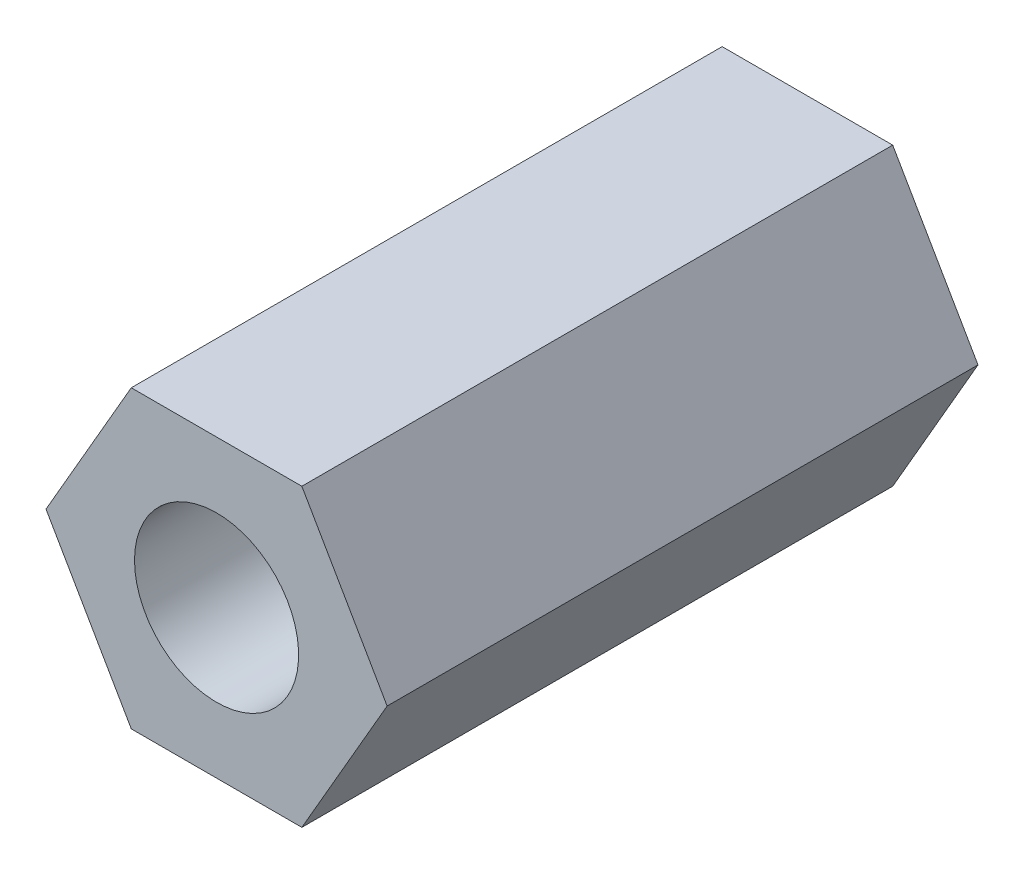
ISO-10303-21;
HEADER;
FILE_DESCRIPTION(('STEP AP214'),'2;1');
FILE_NAME('part.step','',(''),(''),'','','');
FILE_SCHEMA(('AUTOMOTIVE_DESIGN { 1 0 10303 214 1 1 1 1 }'));
ENDSEC;
DATA;
#1=APPLICATION_CONTEXT('core data for automotive mechanical design processes');
#2=APPLICATION_PROTOCOL_DEFINITION('international standard','automotive_design',2000,#1);
#3=PRODUCT_CONTEXT('',#1,'mechanical');
#4=PRODUCT('Part','Part','',(#3));
#5=PRODUCT_RELATED_PRODUCT_CATEGORY('part','',(#4));
#6=PRODUCT_DEFINITION_FORMATION('','',#4);
#7=PRODUCT_DEFINITION_CONTEXT('part definition',#1,'design');
#8=PRODUCT_DEFINITION('design','',#6,#7);
#9=PRODUCT_DEFINITION_SHAPE('','',#8);
#10=(LENGTH_UNIT() NAMED_UNIT(*) SI_UNIT(.MILLI.,.METRE.));
#11=(NAMED_UNIT(*) PLANE_ANGLE_UNIT() SI_UNIT($,.RADIAN.));
#12=(NAMED_UNIT(*) SI_UNIT($,.STERADIAN.) SOLID_ANGLE_UNIT());
#13=UNCERTAINTY_MEASURE_WITH_UNIT(LENGTH_MEASURE(1.E-05),#10,'distance_accuracy_value','');
#14=(GEOMETRIC_REPRESENTATION_CONTEXT(3) GLOBAL_UNCERTAINTY_ASSIGNED_CONTEXT((#13)) GLOBAL_UNIT_ASSIGNED_CONTEXT((#10,
#11,#12)) REPRESENTATION_CONTEXT('',''));
#15=CARTESIAN_POINT('',(0.,0.,0.));
#16=DIRECTION('',(0.,0.,1.));
#17=DIRECTION('',(1.,0.,0.));
#18=AXIS2_PLACEMENT_3D('',#15,#16,#17);
#19=CARTESIAN_POINT('',(1.29903810567668,-2.24999999999998,9.));
#20=DIRECTION('',(-0.866025403784441,0.499999999999995,0.));
#21=DIRECTION('',(-0.499999999999995,-0.866025403784441,0.));
#22=AXIS2_PLACEMENT_3D('',#19,#20,#21);
#23=PLANE('',#22);
#24=DIRECTION('',(0.499999999999995,0.866025403784441,0.));
#25=VECTOR('',#24,1.);
#26=CARTESIAN_POINT('',(1.29903810567668,-2.24999999999998,0.));
#27=LINE('',#26,#25);
#28=CARTESIAN_POINT('',(1.29903810567668,-2.24999999999998,0.));
#29=VERTEX_POINT('',#28);
#30=CARTESIAN_POINT('',(2.59807621135331,0.,0.));
#31=VERTEX_POINT('',#30);
#32=EDGE_CURVE('E127',#29,#31,#27,.T.);
#33=ORIENTED_EDGE('',*,*,#32,.T.);
#34=DIRECTION('',(0.,0.,-1.));
#35=VECTOR('',#34,1.);
#36=CARTESIAN_POINT('',(2.59807621135331,0.,9.));
#37=LINE('',#36,#35);
#38=CARTESIAN_POINT('',(2.59807621135331,0.,9.));
#39=VERTEX_POINT('',#38);
#40=EDGE_CURVE('E11',#39,#31,#37,.T.);
#41=ORIENTED_EDGE('',*,*,#40,.F.);
#42=DIRECTION('',(0.499999999999995,0.866025403784441,0.));
#43=VECTOR('',#42,1.);
#44=CARTESIAN_POINT('',(1.29903810567668,-2.24999999999998,9.));
#45=LINE('',#44,#43);
#46=CARTESIAN_POINT('',(1.29903810567668,-2.24999999999998,9.));
#47=VERTEX_POINT('',#46);
#48=EDGE_CURVE('E138',#47,#39,#45,.T.);
#49=ORIENTED_EDGE('',*,*,#48,.F.);
#50=DIRECTION('',(0.,0.,-1.));
#51=VECTOR('',#50,1.);
#52=CARTESIAN_POINT('',(1.29903810567668,-2.24999999999998,9.));
#53=LINE('',#52,#51);
#54=EDGE_CURVE('E123',#47,#29,#53,.T.);
#55=ORIENTED_EDGE('',*,*,#54,.T.);
#56=EDGE_LOOP('',(#33,#41,#49,#55));
#57=FACE_BOUND('',#56,.T.);
#58=ADVANCED_FACE('F43',(#57),#23,.F.);
#59=CARTESIAN_POINT('',(2.59807621135331,0.,9.));
#60=DIRECTION('',(-0.866025403784438,-0.500000000000001,0.));
#61=DIRECTION('',(0.500000000000001,-0.866025403784438,0.));
#62=AXIS2_PLACEMENT_3D('',#59,#60,#61);
#63=PLANE('',#62);
#64=DIRECTION('',(-0.500000000000001,0.866025403784438,0.));
#65=VECTOR('',#64,1.);
#66=CARTESIAN_POINT('',(2.59807621135331,0.,0.));
#67=LINE('',#66,#65);
#68=CARTESIAN_POINT('',(1.29903810567665,2.25,0.));
#69=VERTEX_POINT('',#68);
#70=EDGE_CURVE('E130',#31,#69,#67,.T.);
#71=ORIENTED_EDGE('',*,*,#70,.T.);
#72=DIRECTION('',(0.,0.,-1.));
#73=VECTOR('',#72,1.);
#74=CARTESIAN_POINT('',(1.29903810567665,2.25,9.));
#75=LINE('',#74,#73);
#76=CARTESIAN_POINT('',(1.29903810567665,2.25,9.));
#77=VERTEX_POINT('',#76);
#78=EDGE_CURVE('E51',#77,#69,#75,.T.);
#79=ORIENTED_EDGE('',*,*,#78,.F.);
#80=DIRECTION('',(-0.500000000000001,0.866025403784438,0.));
#81=VECTOR('',#80,1.);
#82=CARTESIAN_POINT('',(2.59807621135331,0.,9.));
#83=LINE('',#82,#81);
#84=EDGE_CURVE('E96',#39,#77,#83,.T.);
#85=ORIENTED_EDGE('',*,*,#84,.F.);
#86=ORIENTED_EDGE('',*,*,#40,.T.);
#87=EDGE_LOOP('',(#71,#79,#85,#86));
#88=FACE_BOUND('',#87,.T.);
#89=ADVANCED_FACE('F163',(#88),#63,.F.);
#90=CARTESIAN_POINT('',(1.29903810567665,2.25,9.));
#91=DIRECTION('',(0.,-1.,0.));
#92=DIRECTION('',(1.,0.,0.));
#93=AXIS2_PLACEMENT_3D('',#90,#91,#92);
#94=PLANE('',#93);
#95=DIRECTION('',(-1.,0.,0.));
#96=VECTOR('',#95,1.);
#97=CARTESIAN_POINT('',(1.29903810567665,2.25,0.));
#98=LINE('',#97,#96);
#99=CARTESIAN_POINT('',(-1.29903810567667,2.24999999999999,0.));
#100=VERTEX_POINT('',#99);
#101=EDGE_CURVE('E133',#69,#100,#98,.T.);
#102=ORIENTED_EDGE('',*,*,#101,.T.);
#103=DIRECTION('',(0.,0.,-1.));
#104=VECTOR('',#103,1.);
#105=CARTESIAN_POINT('',(-1.29903810567667,2.24999999999999,9.));
#106=LINE('',#105,#104);
#107=CARTESIAN_POINT('',(-1.29903810567667,2.24999999999999,9.));
#108=VERTEX_POINT('',#107);
#109=EDGE_CURVE('E118',#108,#100,#106,.T.);
#110=ORIENTED_EDGE('',*,*,#109,.F.);
#111=DIRECTION('',(-1.,0.,0.));
#112=VECTOR('',#111,1.);
#113=CARTESIAN_POINT('',(1.29903810567665,2.25,9.));
#114=LINE('',#113,#112);
#115=EDGE_CURVE('E109',#77,#108,#114,.T.);
#116=ORIENTED_EDGE('',*,*,#115,.F.);
#117=ORIENTED_EDGE('',*,*,#78,.T.);
#118=EDGE_LOOP('',(#102,#110,#116,#117));
#119=FACE_BOUND('',#118,.T.);
#120=ADVANCED_FACE('F144',(#119),#94,.F.);
#121=CARTESIAN_POINT('',(-1.29903810567667,2.24999999999999,9.));
#122=DIRECTION('',(0.866025403784442,-0.499999999999995,0.));
#123=DIRECTION('',(0.499999999999995,0.866025403784442,0.));
#124=AXIS2_PLACEMENT_3D('',#121,#122,#123);
#125=PLANE('',#124);
#126=DIRECTION('',(-0.499999999999995,-0.866025403784442,0.));
#127=VECTOR('',#126,1.);
#128=CARTESIAN_POINT('',(-1.29903810567667,2.24999999999999,0.));
#129=LINE('',#128,#127);
#130=CARTESIAN_POINT('',(-2.59807621135331,0.,0.));
#131=VERTEX_POINT('',#130);
#132=EDGE_CURVE('E117',#100,#131,#129,.T.);
#133=ORIENTED_EDGE('',*,*,#132,.T.);
#134=DIRECTION('',(0.,0.,-1.));
#135=VECTOR('',#134,1.);
#136=CARTESIAN_POINT('',(-2.59807621135331,0.,9.));
#137=LINE('',#136,#135);
#138=CARTESIAN_POINT('',(-2.59807621135331,0.,9.));
#139=VERTEX_POINT('',#138);
#140=EDGE_CURVE('E114',#139,#131,#137,.T.);
#141=ORIENTED_EDGE('',*,*,#140,.F.);
#142=DIRECTION('',(-0.499999999999995,-0.866025403784442,0.));
#143=VECTOR('',#142,1.);
#144=CARTESIAN_POINT('',(-1.29903810567667,2.24999999999999,9.));
#145=LINE('',#144,#143);
#146=EDGE_CURVE('E103',#108,#139,#145,.T.);
#147=ORIENTED_EDGE('',*,*,#146,.F.);
#148=ORIENTED_EDGE('',*,*,#109,.T.);
#149=EDGE_LOOP('',(#133,#141,#147,#148));
#150=FACE_BOUND('',#149,.T.);
#151=ADVANCED_FACE('F115',(#150),#125,.F.);
#152=CARTESIAN_POINT('',(-2.59807621135331,0.,9.));
#153=DIRECTION('',(0.866025403784435,0.500000000000007,0.));
#154=DIRECTION('',(-0.500000000000007,0.866025403784435,0.));
#155=AXIS2_PLACEMENT_3D('',#152,#153,#154);
#156=PLANE('',#155);
#157=DIRECTION('',(0.500000000000007,-0.866025403784435,0.));
#158=VECTOR('',#157,1.);
#159=CARTESIAN_POINT('',(-2.59807621135331,0.,0.));
#160=LINE('',#159,#158);
#161=CARTESIAN_POINT('',(-1.29903810567663,-2.25000000000001,0.));
#162=VERTEX_POINT('',#161);
#163=EDGE_CURVE('E82',#131,#162,#160,.T.);
#164=ORIENTED_EDGE('',*,*,#163,.T.);
#165=DIRECTION('',(0.,0.,-1.));
#166=VECTOR('',#165,1.);
#167=CARTESIAN_POINT('',(-1.29903810567663,-2.25000000000001,9.));
#168=LINE('',#167,#166);
#169=CARTESIAN_POINT('',(-1.29903810567663,-2.25000000000001,9.));
#170=VERTEX_POINT('',#169);
#171=EDGE_CURVE('E119',#170,#162,#168,.T.);
#172=ORIENTED_EDGE('',*,*,#171,.F.);
#173=DIRECTION('',(0.500000000000007,-0.866025403784435,0.));
#174=VECTOR('',#173,1.);
#175=CARTESIAN_POINT('',(-2.59807621135331,0.,9.));
#176=LINE('',#175,#174);
#177=EDGE_CURVE('E107',#139,#170,#176,.T.);
#178=ORIENTED_EDGE('',*,*,#177,.F.);
#179=ORIENTED_EDGE('',*,*,#140,.T.);
#180=EDGE_LOOP('',(#164,#172,#178,#179));
#181=FACE_BOUND('',#180,.T.);
#182=ADVANCED_FACE('F121',(#181),#156,.F.);
#183=CARTESIAN_POINT('',(-1.29903810567663,-2.25000000000001,9.));
#184=DIRECTION('',(0.,1.,0.));
#185=DIRECTION('',(-1.,0.,0.));
#186=AXIS2_PLACEMENT_3D('',#183,#184,#185);
#187=PLANE('',#186);
#188=DIRECTION('',(1.,0.,0.));
#189=VECTOR('',#188,1.);
#190=CARTESIAN_POINT('',(-1.29903810567663,-2.25000000000001,0.));
#191=LINE('',#190,#189);
#192=EDGE_CURVE('E88',#162,#29,#191,.T.);
#193=ORIENTED_EDGE('',*,*,#192,.T.);
#194=ORIENTED_EDGE('',*,*,#54,.F.);
#195=DIRECTION('',(1.,0.,0.));
#196=VECTOR('',#195,1.);
#197=CARTESIAN_POINT('',(-1.29903810567663,-2.25000000000001,9.));
#198=LINE('',#197,#196);
#199=EDGE_CURVE('E59',#170,#47,#198,.T.);
#200=ORIENTED_EDGE('',*,*,#199,.F.);
#201=ORIENTED_EDGE('',*,*,#171,.T.);
#202=EDGE_LOOP('',(#193,#194,#200,#201));
#203=FACE_BOUND('',#202,.T.);
#204=ADVANCED_FACE('F151',(#203),#187,.F.);
#205=CARTESIAN_POINT('',(0.,0.,9.));
#206=DIRECTION('',(0.,0.,1.));
#207=DIRECTION('',(1.,0.,0.));
#208=AXIS2_PLACEMENT_3D('',#205,#206,#207);
#209=PLANE('',#208);
#210=CARTESIAN_POINT('',(0.,0.,9.));
#211=DIRECTION('',(0.,0.,-1.));
#212=DIRECTION('',(-1.,0.,0.));
#213=AXIS2_PLACEMENT_3D('',#210,#211,#212);
#214=CIRCLE('',#213,1.25);
#215=CARTESIAN_POINT('',(-1.25,0.,9.));
#216=VERTEX_POINT('',#215);
#217=EDGE_CURVE('E131',#216,#216,#214,.T.);
#218=ORIENTED_EDGE('',*,*,#217,.T.);
#219=EDGE_LOOP('',(#218));
#220=FACE_BOUND('',#219,.T.);
#221=ORIENTED_EDGE('',*,*,#48,.T.);
#222=ORIENTED_EDGE('',*,*,#84,.T.);
#223=ORIENTED_EDGE('',*,*,#115,.T.);
#224=ORIENTED_EDGE('',*,*,#146,.T.);
#225=ORIENTED_EDGE('',*,*,#177,.T.);
#226=ORIENTED_EDGE('',*,*,#199,.T.);
#227=EDGE_LOOP('',(#221,#222,#223,#224,#225,#226));
#228=FACE_BOUND('',#227,.T.);
#229=ADVANCED_FACE('F105',(#220,#228),#209,.T.);
#230=CARTESIAN_POINT('',(0.,0.,0.));
#231=DIRECTION('',(0.,0.,1.));
#232=DIRECTION('',(1.,0.,0.));
#233=AXIS2_PLACEMENT_3D('',#230,#231,#232);
#234=PLANE('',#233);
#235=CARTESIAN_POINT('',(0.,0.,0.));
#236=DIRECTION('',(0.,0.,-1.));
#237=DIRECTION('',(-1.,0.,0.));
#238=AXIS2_PLACEMENT_3D('',#235,#236,#237);
#239=CIRCLE('',#238,1.24999999999999);
#240=CARTESIAN_POINT('',(-1.24999999999999,0.,0.));
#241=VERTEX_POINT('',#240);
#242=EDGE_CURVE('E284',#241,#241,#239,.T.);
#243=ORIENTED_EDGE('',*,*,#242,.F.);
#244=EDGE_LOOP('',(#243));
#245=FACE_BOUND('',#244,.T.);
#246=ORIENTED_EDGE('',*,*,#32,.F.);
#247=ORIENTED_EDGE('',*,*,#192,.F.);
#248=ORIENTED_EDGE('',*,*,#163,.F.);
#249=ORIENTED_EDGE('',*,*,#132,.F.);
#250=ORIENTED_EDGE('',*,*,#101,.F.);
#251=ORIENTED_EDGE('',*,*,#70,.F.);
#252=EDGE_LOOP('',(#246,#247,#248,#249,#250,#251));
#253=FACE_BOUND('',#252,.T.);
#254=ADVANCED_FACE('F147',(#245,#253),#234,.F.);
#255=CARTESIAN_POINT('',(0.,0.,0.));
#256=DIRECTION('',(0.,0.,-1.));
#257=DIRECTION('',(-1.,0.,0.));
#258=AXIS2_PLACEMENT_3D('',#255,#256,#257);
#259=CYLINDRICAL_SURFACE('',#258,1.24999999999999);
#260=ORIENTED_EDGE('',*,*,#217,.F.);
#261=EDGE_LOOP('',(#260));
#262=FACE_BOUND('',#261,.T.);
#263=ORIENTED_EDGE('',*,*,#242,.T.);
#264=EDGE_LOOP('',(#263));
#265=FACE_BOUND('',#264,.T.);
#266=ADVANCED_FACE('F200',(#262,#265),#259,.F.);
#267=CLOSED_SHELL('',(#58,#89,#120,#151,#182,#204,#229,#254,#266));
#268=MANIFOLD_SOLID_BREP('B2',#267);
#269=ADVANCED_BREP_SHAPE_REPRESENTATION('',(#18,#268),#14);
#270=SHAPE_DEFINITION_REPRESENTATION(#9,#269);
ENDSEC;
END-ISO-10303-21;
